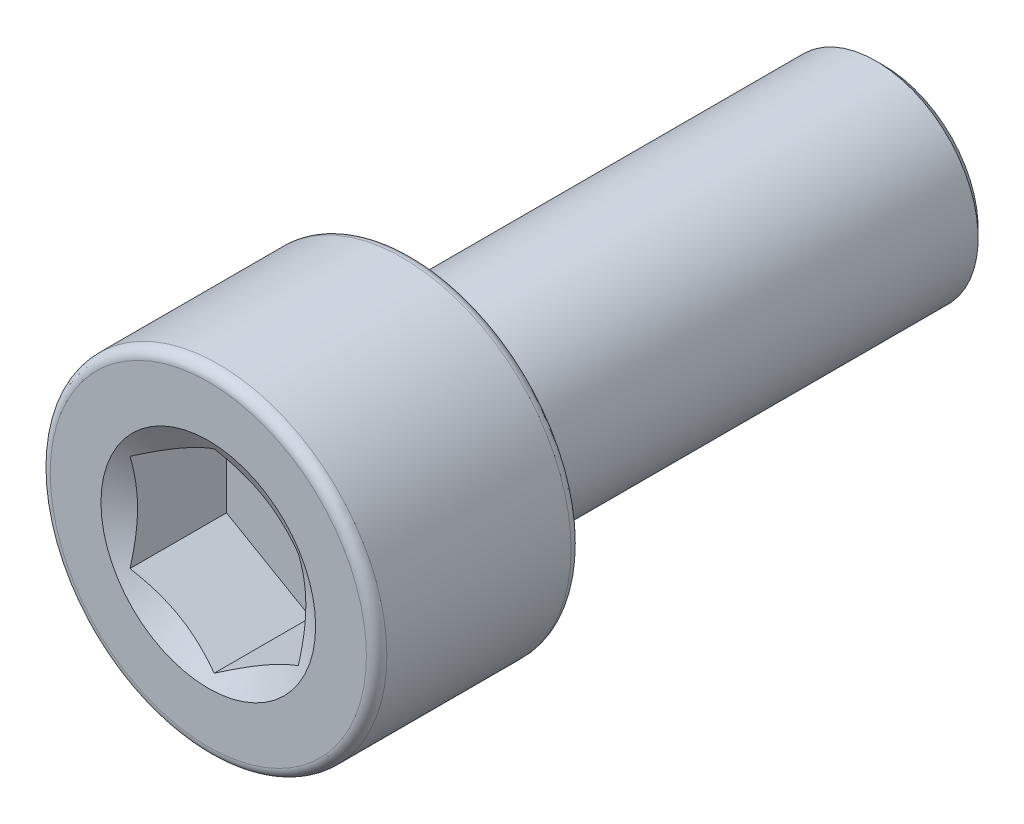
ISO-10303-21;
HEADER;
FILE_DESCRIPTION(('STEP AP214'),'2;1');
FILE_NAME('part.step','',(''),(''),'','','');
FILE_SCHEMA(('AUTOMOTIVE_DESIGN { 1 0 10303 214 1 1 1 1 }'));
ENDSEC;
DATA;
#1=APPLICATION_CONTEXT('core data for automotive mechanical design processes');
#2=APPLICATION_PROTOCOL_DEFINITION('international standard','automotive_design',2000,#1);
#3=PRODUCT_CONTEXT('',#1,'mechanical');
#4=PRODUCT('Part','Part','',(#3));
#5=PRODUCT_RELATED_PRODUCT_CATEGORY('part','',(#4));
#6=PRODUCT_DEFINITION_FORMATION('','',#4);
#7=PRODUCT_DEFINITION_CONTEXT('part definition',#1,'design');
#8=PRODUCT_DEFINITION('design','',#6,#7);
#9=PRODUCT_DEFINITION_SHAPE('','',#8);
#10=(LENGTH_UNIT() NAMED_UNIT(*) SI_UNIT(.MILLI.,.METRE.));
#11=(NAMED_UNIT(*) PLANE_ANGLE_UNIT() SI_UNIT($,.RADIAN.));
#12=(NAMED_UNIT(*) SI_UNIT($,.STERADIAN.) SOLID_ANGLE_UNIT());
#13=UNCERTAINTY_MEASURE_WITH_UNIT(LENGTH_MEASURE(1.E-05),#10,'distance_accuracy_value','');
#14=(GEOMETRIC_REPRESENTATION_CONTEXT(3) GLOBAL_UNCERTAINTY_ASSIGNED_CONTEXT((#13)) GLOBAL_UNIT_ASSIGNED_CONTEXT((#10,
#11,#12)) REPRESENTATION_CONTEXT('',''));
#15=CARTESIAN_POINT('',(0.,0.,0.));
#16=DIRECTION('',(0.,0.,1.));
#17=DIRECTION('',(1.,0.,0.));
#18=AXIS2_PLACEMENT_3D('',#15,#16,#17);
#19=CARTESIAN_POINT('',(0.,0.,-7.96925));
#20=DIRECTION('',(0.,0.,-1.));
#21=DIRECTION('',(-1.,0.,0.));
#22=AXIS2_PLACEMENT_3D('',#19,#20,#21);
#23=PLANE('',#22);
#24=CARTESIAN_POINT('',(0.,0.,-7.96925));
#25=DIRECTION('',(0.,0.,-1.));
#26=DIRECTION('',(-1.,0.,0.));
#27=AXIS2_PLACEMENT_3D('',#24,#25,#26);
#28=CIRCLE('',#27,2.21456250000001);
#29=CARTESIAN_POINT('',(-2.21456250000001,0.,-7.96925));
#30=VERTEX_POINT('',#29);
#31=EDGE_CURVE('E52',#30,#30,#28,.T.);
#32=ORIENTED_EDGE('',*,*,#31,.T.);
#33=EDGE_LOOP('',(#32));
#34=FACE_BOUND('',#33,.T.);
#35=ADVANCED_FACE('F39',(#34),#23,.T.);
#36=CARTESIAN_POINT('',(0.,0.,-7.96925));
#37=DIRECTION('',(0.,0.,1.));
#38=DIRECTION('',(1.,0.,0.));
#39=AXIS2_PLACEMENT_3D('',#36,#37,#38);
#40=CONICAL_SURFACE('',#39,2.21456250000001,0.785398163397452);
#41=CARTESIAN_POINT('',(0.,0.,-7.77081250000001));
#42=DIRECTION('',(0.,0.,-1.));
#43=DIRECTION('',(-1.,0.,0.));
#44=AXIS2_PLACEMENT_3D('',#41,#42,#43);
#45=CIRCLE('',#44,2.41300000000001);
#46=CARTESIAN_POINT('',(-2.41300000000001,0.,-7.77081250000001));
#47=VERTEX_POINT('',#46);
#48=EDGE_CURVE('E137',#47,#47,#45,.T.);
#49=ORIENTED_EDGE('',*,*,#48,.T.);
#50=EDGE_LOOP('',(#49));
#51=FACE_BOUND('',#50,.T.);
#52=ORIENTED_EDGE('',*,*,#31,.F.);
#53=EDGE_LOOP('',(#52));
#54=FACE_BOUND('',#53,.T.);
#55=ADVANCED_FACE('F143',(#51,#54),#40,.T.);
#56=CARTESIAN_POINT('',(0.,0.,-7.96925));
#57=DIRECTION('',(0.,0.,-1.));
#58=DIRECTION('',(-1.,0.,0.));
#59=AXIS2_PLACEMENT_3D('',#56,#57,#58);
#60=CYLINDRICAL_SURFACE('',#59,2.41300000000001);
#61=CARTESIAN_POINT('',(0.,0.,3.14325));
#62=DIRECTION('',(0.,0.,-1.));
#63=DIRECTION('',(-1.,0.,0.));
#64=AXIS2_PLACEMENT_3D('',#61,#62,#63);
#65=CIRCLE('',#64,2.41300000000001);
#66=CARTESIAN_POINT('',(-2.41300000000001,0.,3.14325));
#67=VERTEX_POINT('',#66);
#68=EDGE_CURVE('E134',#67,#67,#65,.T.);
#69=ORIENTED_EDGE('',*,*,#68,.T.);
#70=EDGE_LOOP('',(#69));
#71=FACE_BOUND('',#70,.T.);
#72=ORIENTED_EDGE('',*,*,#48,.F.);
#73=EDGE_LOOP('',(#72));
#74=FACE_BOUND('',#73,.T.);
#75=ADVANCED_FACE('F145',(#71,#74),#60,.T.);
#76=CARTESIAN_POINT('',(0.,2.413,3.14325));
#77=DIRECTION('',(0.,0.,-1.));
#78=DIRECTION('',(-1.,0.,0.));
#79=AXIS2_PLACEMENT_3D('',#76,#77,#78);
#80=PLANE('',#79);
#81=CARTESIAN_POINT('',(0.,0.,3.14325));
#82=DIRECTION('',(0.,0.,-1.));
#83=DIRECTION('',(-1.,0.,0.));
#84=AXIS2_PLACEMENT_3D('',#81,#82,#83);
#85=CIRCLE('',#84,3.72745);
#86=CARTESIAN_POINT('',(-3.72745,0.,3.14325));
#87=VERTEX_POINT('',#86);
#88=EDGE_CURVE('E131',#87,#87,#85,.T.);
#89=ORIENTED_EDGE('',*,*,#88,.T.);
#90=EDGE_LOOP('',(#89));
#91=FACE_BOUND('',#90,.T.);
#92=ORIENTED_EDGE('',*,*,#68,.F.);
#93=EDGE_LOOP('',(#92));
#94=FACE_BOUND('',#93,.T.);
#95=ADVANCED_FACE('F151',(#91,#94),#80,.T.);
#96=CARTESIAN_POINT('',(0.,0.,3.38455));
#97=DIRECTION('',(0.,0.,-1.));
#98=DIRECTION('',(-1.,0.,0.));
#99=AXIS2_PLACEMENT_3D('',#96,#97,#98);
#100=TOROIDAL_SURFACE('',#99,3.72745,0.241299999999999);
#101=CARTESIAN_POINT('',(0.,0.,3.38455));
#102=DIRECTION('',(0.,0.,-1.));
#103=DIRECTION('',(-1.,0.,0.));
#104=AXIS2_PLACEMENT_3D('',#101,#102,#103);
#105=CIRCLE('',#104,3.96875);
#106=CARTESIAN_POINT('',(-3.96875,0.,3.38455));
#107=VERTEX_POINT('',#106);
#108=EDGE_CURVE('E128',#107,#107,#105,.T.);
#109=ORIENTED_EDGE('',*,*,#108,.T.);
#110=EDGE_LOOP('',(#109));
#111=FACE_BOUND('',#110,.T.);
#112=ORIENTED_EDGE('',*,*,#88,.F.);
#113=EDGE_LOOP('',(#112));
#114=FACE_BOUND('',#113,.T.);
#115=ADVANCED_FACE('F157',(#111,#114),#100,.T.);
#116=CARTESIAN_POINT('',(0.,0.,-7.96925));
#117=DIRECTION('',(0.,0.,-1.));
#118=DIRECTION('',(-1.,0.,0.));
#119=AXIS2_PLACEMENT_3D('',#116,#117,#118);
#120=CYLINDRICAL_SURFACE('',#119,3.96875);
#121=CARTESIAN_POINT('',(0.,0.,7.72795));
#122=DIRECTION('',(0.,0.,-1.));
#123=DIRECTION('',(-1.,0.,0.));
#124=AXIS2_PLACEMENT_3D('',#121,#122,#123);
#125=CIRCLE('',#124,3.96875);
#126=CARTESIAN_POINT('',(-3.96875,0.,7.72795));
#127=VERTEX_POINT('',#126);
#128=EDGE_CURVE('E125',#127,#127,#125,.T.);
#129=ORIENTED_EDGE('',*,*,#128,.T.);
#130=EDGE_LOOP('',(#129));
#131=FACE_BOUND('',#130,.T.);
#132=ORIENTED_EDGE('',*,*,#108,.F.);
#133=EDGE_LOOP('',(#132));
#134=FACE_BOUND('',#133,.T.);
#135=ADVANCED_FACE('F161',(#131,#134),#120,.T.);
#136=CARTESIAN_POINT('',(0.,0.,7.72795));
#137=DIRECTION('',(0.,0.,-1.));
#138=DIRECTION('',(-1.,0.,0.));
#139=AXIS2_PLACEMENT_3D('',#136,#137,#138);
#140=TOROIDAL_SURFACE('',#139,3.72745,0.241300000000001);
#141=CARTESIAN_POINT('',(0.,0.,7.96925));
#142=DIRECTION('',(0.,0.,-1.));
#143=DIRECTION('',(-1.,0.,0.));
#144=AXIS2_PLACEMENT_3D('',#141,#142,#143);
#145=CIRCLE('',#144,3.72745);
#146=CARTESIAN_POINT('',(-3.72745,0.,7.96925));
#147=VERTEX_POINT('',#146);
#148=EDGE_CURVE('E122',#147,#147,#145,.T.);
#149=ORIENTED_EDGE('',*,*,#148,.T.);
#150=EDGE_LOOP('',(#149));
#151=FACE_BOUND('',#150,.T.);
#152=ORIENTED_EDGE('',*,*,#128,.F.);
#153=EDGE_LOOP('',(#152));
#154=FACE_BOUND('',#153,.T.);
#155=ADVANCED_FACE('F165',(#151,#154),#140,.T.);
#156=CARTESIAN_POINT('',(0.,3.72745,7.96925));
#157=DIRECTION('',(0.,0.,1.));
#158=DIRECTION('',(1.,0.,0.));
#159=AXIS2_PLACEMENT_3D('',#156,#157,#158);
#160=PLANE('',#159);
#161=CARTESIAN_POINT('',(0.,0.,7.96925));
#162=DIRECTION('',(0.,0.,1.));
#163=DIRECTION('',(1.,0.,0.));
#164=AXIS2_PLACEMENT_3D('',#161,#162,#163);
#165=CIRCLE('',#164,2.53070740070527);
#166=CARTESIAN_POINT('',(2.53070740070527,0.,7.96925));
#167=VERTEX_POINT('',#166);
#168=EDGE_CURVE('E259',#167,#167,#165,.T.);
#169=ORIENTED_EDGE('',*,*,#168,.F.);
#170=EDGE_LOOP('',(#169));
#171=FACE_BOUND('',#170,.T.);
#172=ORIENTED_EDGE('',*,*,#148,.F.);
#173=EDGE_LOOP('',(#172));
#174=FACE_BOUND('',#173,.T.);
#175=ADVANCED_FACE('F169',(#171,#174),#160,.T.);
#176=CARTESIAN_POINT('',(0.,0.,7.96925));
#177=DIRECTION('',(0.,0.,1.));
#178=DIRECTION('',(1.,0.,0.));
#179=AXIS2_PLACEMENT_3D('',#176,#177,#178);
#180=CONICAL_SURFACE('',#179,2.53070740070527,1.0471975511966);
#181=ORIENTED_EDGE('',*,*,#168,.T.);
#182=EDGE_LOOP('',(#181));
#183=FACE_BOUND('',#182,.T.);
#184=CARTESIAN_POINT('',(1.984575,1.14556397036932,7.83112873933508));
#185=CARTESIAN_POINT('',(1.89737036121932,1.19591159204393,7.80204774986949));
#186=CARTESIAN_POINT('',(1.809412980695,1.24669380936686,7.77559927565635));
#187=CARTESIAN_POINT('',(1.63197502132768,1.34913766297204,7.72943233883577));
#188=CARTESIAN_POINT('',(1.54249128874368,1.40080112006751,7.70973020987826));
#189=CARTESIAN_POINT('',(1.36463285198753,1.50348773640632,7.67905979956083));
#190=CARTESIAN_POINT('',(1.27628551969391,1.55449509248823,7.66788741034951));
#191=CARTESIAN_POINT('',(1.09917497188905,1.65674991493968,7.65454786368373));
#192=CARTESIAN_POINT('',(1.01041240048945,1.7079970094312,7.65236966208942));
#193=CARTESIAN_POINT('',(0.844542697135339,1.80376192731311,7.65689161913765));
#194=CARTESIAN_POINT('',(0.767410784334094,1.84829405793202,7.66248148108517));
#195=CARTESIAN_POINT('',(0.61364949281092,1.93706818098386,7.68020100152631));
#196=CARTESIAN_POINT('',(0.537020646254477,1.98130986617092,7.69233671795883));
#197=CARTESIAN_POINT('',(0.382942111493218,2.07026714969167,7.72267622647367));
#198=CARTESIAN_POINT('',(0.305511932787318,2.11497148421093,7.74100867692029));
#199=CARTESIAN_POINT('',(0.151806688756413,2.20371324822803,7.78261657402948));
#200=CARTESIAN_POINT('',(0.0755296529470687,2.24775181538554,7.80588223891168));
#201=CARTESIAN_POINT('',(-0.000199999999998771,2.29147435090016,7.83112873933508));
#202=B_SPLINE_CURVE_WITH_KNOTS('',3,(#184,#185,#186,#187,#188,#189,#190,#191,#192,#193,#194,
#195,#196,#197,#198,#199,#200,#201),.UNSPECIFIED.,.F.,.F.,(4,2,2,2,2,2,2,2,4),(0.,
0.314555137114085,0.629866549668805,0.937373439505931,1.24450262309398,1.51196650590478,
1.77967834211414,2.05332989762155,2.32644383656793),.UNSPECIFIED.);
#203=CARTESIAN_POINT('',(1.984375,1.14567944042316,7.8310620676293));
#204=VERTEX_POINT('',#203);
#205=CARTESIAN_POINT('',(0.,2.29135888084633,7.8310620676293));
#206=VERTEX_POINT('',#205);
#207=EDGE_CURVE('E106',#204,#206,#202,.T.);
#208=ORIENTED_EDGE('',*,*,#207,.F.);
#209=CARTESIAN_POINT('',(1.984375,-3.00026729742341,8.58494967649538));
#210=CARTESIAN_POINT('',(1.984375,-2.91417852714619,8.54350549951989));
#211=CARTESIAN_POINT('',(1.984375,-2.82788354366184,8.50248187013908));
#212=CARTESIAN_POINT('',(1.984375,-2.65477109089714,8.42151407198821));
#213=CARTESIAN_POINT('',(1.984375,-2.56795353399495,8.38157009078089));
#214=CARTESIAN_POINT('',(1.984375,-2.39320060303683,8.30278227563891));
#215=CARTESIAN_POINT('',(1.984375,-2.30526165499615,8.26394633973218));
#216=CARTESIAN_POINT('',(1.984375,-2.12865626167959,8.18797175349688));
#217=CARTESIAN_POINT('',(1.984375,-2.03998985361521,8.15083301698271));
#218=CARTESIAN_POINT('',(1.984375,-1.85931319770472,8.07770194440361));
#219=CARTESIAN_POINT('',(1.984375,-1.76727839255488,8.04176992963252));
#220=CARTESIAN_POINT('',(1.984375,-1.5821041626652,7.97281705863807));
#221=CARTESIAN_POINT('',(1.984375,-1.48896461158262,7.93979653909766));
#222=CARTESIAN_POINT('',(1.984375,-1.30163731722863,7.87759140823885));
#223=CARTESIAN_POINT('',(1.984375,-1.20745247053434,7.84839816641305));
#224=CARTESIAN_POINT('',(1.984375,-1.0177273513406,7.79483012996363));
#225=CARTESIAN_POINT('',(1.984375,-0.922187418803865,7.77045414893009));
#226=CARTESIAN_POINT('',(1.984375,-0.730187774437196,7.72786002525467));
#227=CARTESIAN_POINT('',(1.984375,-0.633734462555379,7.7096135885809));
#228=CARTESIAN_POINT('',(1.984375,-0.43971527635355,7.68037130332767));
#229=CARTESIAN_POINT('',(1.984375,-0.342149489314399,7.66937488986504));
#230=CARTESIAN_POINT('',(1.984375,-0.147628044199056,7.65565704177182));
#231=CARTESIAN_POINT('',(1.984375,-0.0506796597421229,7.65283541043542));
#232=CARTESIAN_POINT('',(1.984375,0.143103115571663,7.65543551472701));
#233=CARTESIAN_POINT('',(1.984375,0.239937499827363,7.66085770627661));
#234=CARTESIAN_POINT('',(1.984375,0.476970423936256,7.68374235498862));
#235=CARTESIAN_POINT('',(1.984375,0.616748292390846,7.70557704044363));
#236=CARTESIAN_POINT('',(1.984375,0.893607928884518,7.7623902077941));
#237=CARTESIAN_POINT('',(1.984375,1.03068676882901,7.79738221701726));
#238=CARTESIAN_POINT('',(1.984375,1.30511969999724,7.8776652230234));
#239=CARTESIAN_POINT('',(1.984375,1.44240893450287,7.92317266195429));
#240=CARTESIAN_POINT('',(1.984375,1.64644508842434,7.99651342467351));
#241=CARTESIAN_POINT('',(1.984375,1.71413212999322,8.02180330745833));
#242=CARTESIAN_POINT('',(1.984375,1.84895802350133,8.07380495153986));
#243=CARTESIAN_POINT('',(1.984375,1.91609688529706,8.10051668720586));
#244=CARTESIAN_POINT('',(1.984375,2.09043183263475,8.17166202677584));
#245=CARTESIAN_POINT('',(1.984375,2.19724734382524,8.2170257687467));
#246=CARTESIAN_POINT('',(1.984375,2.40988153193631,8.31003954608462));
#247=CARTESIAN_POINT('',(1.984375,2.51570012860562,8.35768976366227));
#248=CARTESIAN_POINT('',(1.984375,2.72655852247191,8.45475050523556));
#249=CARTESIAN_POINT('',(1.984375,2.83159810540155,8.50416149331034));
#250=CARTESIAN_POINT('',(1.984375,3.04102680140027,8.60434549136321));
#251=CARTESIAN_POINT('',(1.984375,3.14541589892039,8.65511853374661));
#252=CARTESIAN_POINT('',(1.984375,3.4580593439273,8.80916123856077));
#253=CARTESIAN_POINT('',(1.984375,3.66552471194406,8.91403051024588));
#254=CARTESIAN_POINT('',(1.984375,4.0790050250744,9.12649215286083));
#255=CARTESIAN_POINT('',(1.984375,4.28502019488326,9.23408408951456));
#256=CARTESIAN_POINT('',(1.984375,4.67597606585555,9.44054455222795));
#257=CARTESIAN_POINT('',(1.984375,4.86100920560763,9.53923831921385));
#258=CARTESIAN_POINT('',(1.984375,5.23047989061987,9.73775342169799));
#259=CARTESIAN_POINT('',(1.984375,5.41491740749769,9.83757480993869));
#260=CARTESIAN_POINT('',(1.984375,5.7828331411971,10.0377876967862));
#261=CARTESIAN_POINT('',(1.984375,5.96631260293183,10.1381769102676));
#262=CARTESIAN_POINT('',(1.984375,6.33289930192257,10.3396059236772));
#263=CARTESIAN_POINT('',(1.984375,6.51600656168202,10.4406456826348));
#264=CARTESIAN_POINT('',(1.984375,6.69898126466822,10.5419233706002));
#265=B_SPLINE_CURVE_WITH_KNOTS('',3,(#209,#210,#211,#212,#213,#214,#215,#216,#217,#218,#219,
#220,#221,#222,#223,#224,#225,#226,#227,#228,#229,#230,#231,#232,#233,#234,#235,#236,#237,#238,
#239,#240,#241,#242,#243,#244,#245,#246,#247,#248,#249,#250,#251,#252,#253,#254,#255,#256,#257,
#258,#259,#260,#261,#262,#263,#264),.UNSPECIFIED.,.F.,.F.,(4,2,2,2,2,2,2,2,2,2,2,2,2,2,2,2,2,2,
2,2,2,2,2,2,2,2,2,4),(0.,0.286639682230868,0.573328845206282,0.861712521681002,1.15008153741611,
1.4464446575425,1.74284200403624,2.03855903673009,2.33420314830461,2.62846318470746,
2.92270029122633,3.21331540991079,3.50394660154197,3.92748841830872,4.35146688350436,
4.78510306957841,5.00186448248402,5.2186219893087,5.56673163285506,5.91486906368419,
6.26309894038448,6.61133710935792,7.30869129939502,8.00593495112095,8.6350556277527,
9.26420585322016,9.89164710445796,10.5190492194134),.UNSPECIFIED.);
#266=CARTESIAN_POINT('',(1.984375,-1.14567944042316,7.8310620676293));
#267=VERTEX_POINT('',#266);
#268=EDGE_CURVE('E215',#267,#204,#265,.T.);
#269=ORIENTED_EDGE('',*,*,#268,.F.);
#270=CARTESIAN_POINT('',(-0.000200000000001408,-2.29147435090016,7.83112873933508));
#271=CARTESIAN_POINT('',(0.0870046387806746,-2.24112672922556,7.80204774986949));
#272=CARTESIAN_POINT('',(0.174962019304995,-2.19034451190263,7.77559927565635));
#273=CARTESIAN_POINT('',(0.352399978672318,-2.08790065829744,7.72943233883577));
#274=CARTESIAN_POINT('',(0.441883711256317,-2.03623720120198,7.70973020987826));
#275=CARTESIAN_POINT('',(0.619742148012467,-1.93355058486317,7.67905979956083));
#276=CARTESIAN_POINT('',(0.708089480306091,-1.88254322878126,7.66788741034951));
#277=CARTESIAN_POINT('',(0.885200028110948,-1.78028840632981,7.65454786368373));
#278=CARTESIAN_POINT('',(0.973962599510545,-1.72904131183829,7.65236966208942));
#279=CARTESIAN_POINT('',(1.13983230286466,-1.63327639395638,7.65689161913765));
#280=CARTESIAN_POINT('',(1.2169642156659,-1.58874426333747,7.66248148108517));
#281=CARTESIAN_POINT('',(1.37072550718908,-1.49997014028562,7.68020100152631));
#282=CARTESIAN_POINT('',(1.44735435374552,-1.45572845509857,7.69233671795882));
#283=CARTESIAN_POINT('',(1.60143288850678,-1.36677117157782,7.72267622647366));
#284=CARTESIAN_POINT('',(1.67886306721268,-1.32206683705856,7.74100867692029));
#285=CARTESIAN_POINT('',(1.83256831124359,-1.23332507304146,7.78261657402948));
#286=CARTESIAN_POINT('',(1.90884534705293,-1.18928650588395,7.80588223891168));
#287=CARTESIAN_POINT('',(1.984575,-1.14556397036933,7.83112873933508));
#288=B_SPLINE_CURVE_WITH_KNOTS('',3,(#270,#271,#272,#273,#274,#275,#276,#277,#278,#279,#280,
#281,#282,#283,#284,#285,#286,#287),.UNSPECIFIED.,.F.,.F.,(4,2,2,2,2,2,2,2,4),(0.,
0.314555137114085,0.629866549668806,0.937373439505932,1.24450262309398,1.51196650590478,
1.77967834211415,2.05332989762155,2.32644383656793),.UNSPECIFIED.);
#289=CARTESIAN_POINT('',(0.,-2.29135888084633,7.8310620676293));
#290=VERTEX_POINT('',#289);
#291=EDGE_CURVE('E209',#290,#267,#288,.T.);
#292=ORIENTED_EDGE('',*,*,#291,.F.);
#293=CARTESIAN_POINT('',(-1.984575,-1.14556397036933,7.83112873933508));
#294=CARTESIAN_POINT('',(-1.89737036121932,-1.19591159204393,7.80204774986949));
#295=CARTESIAN_POINT('',(-1.809412980695,-1.24669380936686,7.77559927565635));
#296=CARTESIAN_POINT('',(-1.63197502132768,-1.34913766297205,7.72943233883577));
#297=CARTESIAN_POINT('',(-1.54249128874368,-1.40080112006751,7.70973020987826));
#298=CARTESIAN_POINT('',(-1.36463285198753,-1.50348773640632,7.67905979956083));
#299=CARTESIAN_POINT('',(-1.27628551969391,-1.55449509248823,7.66788741034951));
#300=CARTESIAN_POINT('',(-1.09917497188905,-1.65674991493968,7.65454786368373));
#301=CARTESIAN_POINT('',(-1.01041240048945,-1.70799700943121,7.65236966208942));
#302=CARTESIAN_POINT('',(-0.844542697135338,-1.80376192731311,7.65689161913765));
#303=CARTESIAN_POINT('',(-0.767410784334093,-1.84829405793202,7.66248148108517));
#304=CARTESIAN_POINT('',(-0.613649492810919,-1.93706818098387,7.68020100152631));
#305=CARTESIAN_POINT('',(-0.537020646254476,-1.98130986617092,7.69233671795883));
#306=CARTESIAN_POINT('',(-0.382942111493217,-2.07026714969167,7.72267622647367));
#307=CARTESIAN_POINT('',(-0.305511932787318,-2.11497148421093,7.74100867692029));
#308=CARTESIAN_POINT('',(-0.151806688756412,-2.20371324822803,7.78261657402948));
#309=CARTESIAN_POINT('',(-0.0755296529470686,-2.24775181538554,7.80588223891168));
#310=CARTESIAN_POINT('',(0.000199999999998751,-2.29147435090016,7.83112873933508));
#311=B_SPLINE_CURVE_WITH_KNOTS('',3,(#293,#294,#295,#296,#297,#298,#299,#300,#301,#302,#303,
#304,#305,#306,#307,#308,#309,#310),.UNSPECIFIED.,.F.,.F.,(4,2,2,2,2,2,2,2,4),(0.,
0.314555137114085,0.629866549668805,0.937373439505931,1.24450262309398,1.51196650590478,
1.77967834211414,2.05332989762154,2.32644383656793),.UNSPECIFIED.);
#312=CARTESIAN_POINT('',(-1.984375,-1.14567944042316,7.8310620676293));
#313=VERTEX_POINT('',#312);
#314=EDGE_CURVE('E59',#313,#290,#311,.T.);
#315=ORIENTED_EDGE('',*,*,#314,.F.);
#316=CARTESIAN_POINT('',(-1.984375,-3.00026729754376,8.58494967655334));
#317=CARTESIAN_POINT('',(-1.984375,-2.9141785272625,8.54350549957539));
#318=CARTESIAN_POINT('',(-1.984375,-2.82788354377411,8.50248187019213));
#319=CARTESIAN_POINT('',(-1.984375,-2.65477109100131,8.42151407203638));
#320=CARTESIAN_POINT('',(-1.984375,-2.56795353409507,8.38157009082663));
#321=CARTESIAN_POINT('',(-1.984375,-2.39320060312877,8.30278227567976));
#322=CARTESIAN_POINT('',(-1.984375,-2.30526165508396,8.2639463397706));
#323=CARTESIAN_POINT('',(-1.984375,-2.12865626175912,8.18797175353045));
#324=CARTESIAN_POINT('',(-1.984375,-2.03998985369058,8.15083301701388));
#325=CARTESIAN_POINT('',(-1.984375,-1.85931319777155,8.07770194442997));
#326=CARTESIAN_POINT('',(-1.984375,-1.7672783926173,8.04176992965647));
#327=CARTESIAN_POINT('',(-1.984375,-1.58210416271874,7.97281705865731));
#328=CARTESIAN_POINT('',(-1.984375,-1.48896461163169,7.93979653911462));
#329=CARTESIAN_POINT('',(-1.984375,-1.30163731726866,7.87759140825147));
#330=CARTESIAN_POINT('',(-1.984375,-1.20745247056981,7.84839816642363));
#331=CARTESIAN_POINT('',(-1.984375,-1.01772735136682,7.79483012997047));
#332=CARTESIAN_POINT('',(-1.984375,-0.922187418825392,7.77045414893523));
#333=CARTESIAN_POINT('',(-1.984375,-0.730187774446772,7.72786002525643));
#334=CARTESIAN_POINT('',(-1.984375,-0.63373446255766,7.70961358858111));
#335=CARTESIAN_POINT('',(-1.984375,-0.439715276341083,7.68037130332592));
#336=CARTESIAN_POINT('',(-1.984375,-0.342149489294478,7.66937488986287));
#337=CARTESIAN_POINT('',(-1.984375,-0.147628044164359,7.65565704177013));
#338=CARTESIAN_POINT('',(-1.984375,-0.0506796597001036,7.65283541043459));
#339=CARTESIAN_POINT('',(-1.984375,0.143103115628193,7.65543551472916));
#340=CARTESIAN_POINT('',(-1.984375,0.239937499891084,7.66085770628085));
#341=CARTESIAN_POINT('',(-1.984375,0.476970424011514,7.68374235499865));
#342=CARTESIAN_POINT('',(-1.984375,0.616748292470371,7.70557704045721));
#343=CARTESIAN_POINT('',(-1.984375,0.893607928972295,7.76239020781488));
#344=CARTESIAN_POINT('',(-1.984375,1.03068676892077,7.79738221704169));
#345=CARTESIAN_POINT('',(-1.984375,1.305119700097,7.87766522305506));
#346=CARTESIAN_POINT('',(-1.984375,1.44240893460666,7.92317266198955));
#347=CARTESIAN_POINT('',(-1.984375,1.64644508853414,7.996513424714));
#348=CARTESIAN_POINT('',(-1.984375,1.71413213010502,8.02180330750053));
#349=CARTESIAN_POINT('',(-1.984375,1.84895802361712,8.07380495158544));
#350=CARTESIAN_POINT('',(-1.984375,1.91609688541485,8.1005166872531));
#351=CARTESIAN_POINT('',(-1.984375,2.09043183275382,8.17166202682576));
#352=CARTESIAN_POINT('',(-1.984375,2.19724734394363,8.21702576879747));
#353=CARTESIAN_POINT('',(-1.984375,2.40988153205344,8.31003954613687));
#354=CARTESIAN_POINT('',(-1.984375,2.51570012872216,8.35768976371513));
#355=CARTESIAN_POINT('',(-1.984375,2.72655852258734,8.45475050528947));
#356=CARTESIAN_POINT('',(-1.984375,2.83159810551645,8.5041614933647));
#357=CARTESIAN_POINT('',(-1.984375,3.04102680151418,8.60434549141831));
#358=CARTESIAN_POINT('',(-1.984375,3.14541589903382,8.65511853380202));
#359=CARTESIAN_POINT('',(-1.984375,3.45805934403933,8.80916123861694));
#360=CARTESIAN_POINT('',(-1.984375,3.66552471205522,8.91403051030237));
#361=CARTESIAN_POINT('',(-1.984375,4.07900502518394,9.12649215291773));
#362=CARTESIAN_POINT('',(-1.984375,4.28502019499204,9.23408408957157));
#363=CARTESIAN_POINT('',(-1.984375,4.67597606596364,9.44054455228542));
#364=CARTESIAN_POINT('',(-1.984375,4.86100920571578,9.53923831927167));
#365=CARTESIAN_POINT('',(-1.984375,5.23047989072817,9.73775342175647));
#366=CARTESIAN_POINT('',(-1.984375,5.41491740760609,9.83757480999746));
#367=CARTESIAN_POINT('',(-1.984375,5.7828331413058,10.0377876968455));
#368=CARTESIAN_POINT('',(-1.984375,5.96631260304073,10.1381769103272));
#369=CARTESIAN_POINT('',(-1.984375,6.33289930203189,10.3396059237374));
#370=CARTESIAN_POINT('',(-1.984375,6.51600656179157,10.4406456826953));
#371=CARTESIAN_POINT('',(-1.984375,6.69898126477799,10.541923370661));
#372=B_SPLINE_CURVE_WITH_KNOTS('',3,(#316,#317,#318,#319,#320,#321,#322,#323,#324,#325,#326,
#327,#328,#329,#330,#331,#332,#333,#334,#335,#336,#337,#338,#339,#340,#341,#342,#343,#344,#345,
#346,#347,#348,#349,#350,#351,#352,#353,#354,#355,#356,#357,#358,#359,#360,#361,#362,#363,#364,
#365,#366,#367,#368,#369,#370,#371),.UNSPECIFIED.,.F.,.F.,(4,2,2,2,2,2,2,2,2,2,2,2,2,2,2,2,2,2,
2,2,2,2,2,2,2,2,2,4),(0.,0.286639682244971,0.573328845234491,0.86171252172349,1.15008153747288,
1.4464446576142,1.74284200412288,2.03855903683161,2.334203148421,2.62846318484617,
2.92270029138732,3.21331541009358,3.50394660174658,3.9274884185276,4.35146688373754,
4.78510306982646,5.00186448273948,5.21862198957159,5.5667316331171,5.91486906394539,
6.26309894064481,6.61133710961737,7.30869129965259,8.00593495137665,8.63505562800908,
9.2642058534772,9.89164710471596,10.5190492196724),.UNSPECIFIED.);
#373=CARTESIAN_POINT('',(-1.984375,1.14567944042316,7.8310620676293));
#374=VERTEX_POINT('',#373);
#375=EDGE_CURVE('E11',#374,#313,#372,.F.);
#376=ORIENTED_EDGE('',*,*,#375,.F.);
#377=CARTESIAN_POINT('',(0.000200000000001245,2.29147435090016,7.83112873933508));
#378=CARTESIAN_POINT('',(-0.0870046387806749,2.24112672922556,7.80204774986949));
#379=CARTESIAN_POINT('',(-0.174962019304995,2.19034451190263,7.77559927565635));
#380=CARTESIAN_POINT('',(-0.352399978672318,2.08790065829744,7.72943233883577));
#381=CARTESIAN_POINT('',(-0.441883711256317,2.03623720120198,7.70973020987826));
#382=CARTESIAN_POINT('',(-0.619742148012467,1.93355058486317,7.67905979956083));
#383=CARTESIAN_POINT('',(-0.708089480306091,1.88254322878126,7.66788741034951));
#384=CARTESIAN_POINT('',(-0.885200028110948,1.78028840632981,7.65454786368373));
#385=CARTESIAN_POINT('',(-0.973962599510544,1.72904131183828,7.65236966208942));
#386=CARTESIAN_POINT('',(-1.13983230286466,1.63327639395638,7.65689161913765));
#387=CARTESIAN_POINT('',(-1.2169642156659,1.58874426333747,7.66248148108517));
#388=CARTESIAN_POINT('',(-1.37072550718908,1.49997014028562,7.68020100152631));
#389=CARTESIAN_POINT('',(-1.44735435374552,1.45572845509857,7.69233671795882));
#390=CARTESIAN_POINT('',(-1.60143288850678,1.36677117157782,7.72267622647366));
#391=CARTESIAN_POINT('',(-1.67886306721268,1.32206683705856,7.74100867692029));
#392=CARTESIAN_POINT('',(-1.83256831124359,1.23332507304146,7.78261657402948));
#393=CARTESIAN_POINT('',(-1.90884534705293,1.18928650588395,7.80588223891168));
#394=CARTESIAN_POINT('',(-1.984575,1.14556397036932,7.83112873933508));
#395=B_SPLINE_CURVE_WITH_KNOTS('',3,(#377,#378,#379,#380,#381,#382,#383,#384,#385,#386,#387,
#388,#389,#390,#391,#392,#393,#394),.UNSPECIFIED.,.F.,.F.,(4,2,2,2,2,2,2,2,4),(0.,
0.314555137114086,0.629866549668806,0.937373439505932,1.24450262309398,1.51196650590478,
1.77967834211415,2.05332989762155,2.32644383656793),.UNSPECIFIED.);
#396=EDGE_CURVE('E97',#206,#374,#395,.T.);
#397=ORIENTED_EDGE('',*,*,#396,.F.);
#398=EDGE_LOOP('',(#208,#269,#292,#315,#376,#397));
#399=FACE_BOUND('',#398,.T.);
#400=ADVANCED_FACE('F96',(#183,#399),#180,.F.);
#401=CARTESIAN_POINT('',(0.,0.,5.55625));
#402=DIRECTION('',(0.,0.,1.));
#403=DIRECTION('',(1.,0.,0.));
#404=AXIS2_PLACEMENT_3D('',#401,#402,#403);
#405=PLANE('',#404);
#406=DIRECTION('',(-0.866025403784438,-0.5,0.));
#407=VECTOR('',#406,1.);
#408=CARTESIAN_POINT('',(0.,2.29135888084633,5.55625));
#409=LINE('',#408,#407);
#410=CARTESIAN_POINT('',(0.,2.29135888084633,5.55625));
#411=VERTEX_POINT('',#410);
#412=CARTESIAN_POINT('',(-1.984375,1.14567944042316,5.55625));
#413=VERTEX_POINT('',#412);
#414=EDGE_CURVE('E105',#411,#413,#409,.T.);
#415=ORIENTED_EDGE('',*,*,#414,.T.);
#416=DIRECTION('',(0.,-1.,0.));
#417=VECTOR('',#416,1.);
#418=CARTESIAN_POINT('',(-1.984375,1.14567944042316,5.55625));
#419=LINE('',#418,#417);
#420=CARTESIAN_POINT('',(-1.984375,-1.14567944042316,5.55625));
#421=VERTEX_POINT('',#420);
#422=EDGE_CURVE('E110',#413,#421,#419,.T.);
#423=ORIENTED_EDGE('',*,*,#422,.T.);
#424=DIRECTION('',(0.866025403784439,-0.5,0.));
#425=VECTOR('',#424,1.);
#426=CARTESIAN_POINT('',(-1.984375,-1.14567944042316,5.55625));
#427=LINE('',#426,#425);
#428=CARTESIAN_POINT('',(0.,-2.29135888084633,5.55625));
#429=VERTEX_POINT('',#428);
#430=EDGE_CURVE('E241',#421,#429,#427,.T.);
#431=ORIENTED_EDGE('',*,*,#430,.T.);
#432=DIRECTION('',(0.866025403784439,0.5,0.));
#433=VECTOR('',#432,1.);
#434=CARTESIAN_POINT('',(0.,-2.29135888084633,5.55625));
#435=LINE('',#434,#433);
#436=CARTESIAN_POINT('',(1.984375,-1.14567944042316,5.55625));
#437=VERTEX_POINT('',#436);
#438=EDGE_CURVE('E245',#429,#437,#435,.T.);
#439=ORIENTED_EDGE('',*,*,#438,.T.);
#440=DIRECTION('',(0.,1.,0.));
#441=VECTOR('',#440,1.);
#442=CARTESIAN_POINT('',(1.984375,-1.14567944042316,5.55625));
#443=LINE('',#442,#441);
#444=CARTESIAN_POINT('',(1.984375,1.14567944042316,5.55625));
#445=VERTEX_POINT('',#444);
#446=EDGE_CURVE('E118',#437,#445,#443,.T.);
#447=ORIENTED_EDGE('',*,*,#446,.T.);
#448=DIRECTION('',(-0.866025403784438,0.5,0.));
#449=VECTOR('',#448,1.);
#450=CARTESIAN_POINT('',(1.984375,1.14567944042316,5.55625));
#451=LINE('',#450,#449);
#452=EDGE_CURVE('E113',#445,#411,#451,.T.);
#453=ORIENTED_EDGE('',*,*,#452,.T.);
#454=EDGE_LOOP('',(#415,#423,#431,#439,#447,#453));
#455=FACE_BOUND('',#454,.T.);
#456=ADVANCED_FACE('F195',(#455),#405,.T.);
#457=CARTESIAN_POINT('',(-1.984375,1.14567944042316,5.55625));
#458=DIRECTION('',(-1.,0.,0.));
#459=DIRECTION('',(0.,-1.,0.));
#460=AXIS2_PLACEMENT_3D('',#457,#458,#459);
#461=PLANE('',#460);
#462=DIRECTION('',(0.,0.,1.));
#463=VECTOR('',#462,1.);
#464=CARTESIAN_POINT('',(-1.984375,1.14567944042316,5.55625));
#465=LINE('',#464,#463);
#466=EDGE_CURVE('E103',#413,#374,#465,.T.);
#467=ORIENTED_EDGE('',*,*,#466,.T.);
#468=ORIENTED_EDGE('',*,*,#375,.T.);
#469=DIRECTION('',(0.,0.,1.));
#470=VECTOR('',#469,1.);
#471=CARTESIAN_POINT('',(-1.984375,-1.14567944042316,5.55625));
#472=LINE('',#471,#470);
#473=EDGE_CURVE('E112',#421,#313,#472,.T.);
#474=ORIENTED_EDGE('',*,*,#473,.F.);
#475=ORIENTED_EDGE('',*,*,#422,.F.);
#476=EDGE_LOOP('',(#467,#468,#474,#475));
#477=FACE_BOUND('',#476,.T.);
#478=ADVANCED_FACE('F108',(#477),#461,.F.);
#479=CARTESIAN_POINT('',(-1.984375,-1.14567944042316,5.55625));
#480=DIRECTION('',(-0.5,-0.866025403784439,0.));
#481=DIRECTION('',(0.866025403784439,-0.5,0.));
#482=AXIS2_PLACEMENT_3D('',#479,#480,#481);
#483=PLANE('',#482);
#484=ORIENTED_EDGE('',*,*,#473,.T.);
#485=ORIENTED_EDGE('',*,*,#314,.T.);
#486=DIRECTION('',(0.,0.,1.));
#487=VECTOR('',#486,1.);
#488=CARTESIAN_POINT('',(0.,-2.29135888084633,5.55625));
#489=LINE('',#488,#487);
#490=EDGE_CURVE('E115',#429,#290,#489,.T.);
#491=ORIENTED_EDGE('',*,*,#490,.F.);
#492=ORIENTED_EDGE('',*,*,#430,.F.);
#493=EDGE_LOOP('',(#484,#485,#491,#492));
#494=FACE_BOUND('',#493,.T.);
#495=ADVANCED_FACE('F230',(#494),#483,.F.);
#496=CARTESIAN_POINT('',(0.,-2.29135888084633,5.55625));
#497=DIRECTION('',(0.5,-0.866025403784439,0.));
#498=DIRECTION('',(0.866025403784439,0.5,0.));
#499=AXIS2_PLACEMENT_3D('',#496,#497,#498);
#500=PLANE('',#499);
#501=ORIENTED_EDGE('',*,*,#490,.T.);
#502=ORIENTED_EDGE('',*,*,#291,.T.);
#503=DIRECTION('',(0.,0.,1.));
#504=VECTOR('',#503,1.);
#505=CARTESIAN_POINT('',(1.984375,-1.14567944042316,5.55625));
#506=LINE('',#505,#504);
#507=EDGE_CURVE('E255',#437,#267,#506,.T.);
#508=ORIENTED_EDGE('',*,*,#507,.F.);
#509=ORIENTED_EDGE('',*,*,#438,.F.);
#510=EDGE_LOOP('',(#501,#502,#508,#509));
#511=FACE_BOUND('',#510,.T.);
#512=ADVANCED_FACE('F225',(#511),#500,.F.);
#513=CARTESIAN_POINT('',(1.984375,-1.14567944042316,5.55625));
#514=DIRECTION('',(1.,0.,0.));
#515=DIRECTION('',(0.,0.,-1.));
#516=AXIS2_PLACEMENT_3D('',#513,#514,#515);
#517=PLANE('',#516);
#518=ORIENTED_EDGE('',*,*,#507,.T.);
#519=ORIENTED_EDGE('',*,*,#268,.T.);
#520=DIRECTION('',(0.,0.,1.));
#521=VECTOR('',#520,1.);
#522=CARTESIAN_POINT('',(1.984375,1.14567944042316,5.55625));
#523=LINE('',#522,#521);
#524=EDGE_CURVE('E252',#445,#204,#523,.T.);
#525=ORIENTED_EDGE('',*,*,#524,.F.);
#526=ORIENTED_EDGE('',*,*,#446,.F.);
#527=EDGE_LOOP('',(#518,#519,#525,#526));
#528=FACE_BOUND('',#527,.T.);
#529=ADVANCED_FACE('F222',(#528),#517,.F.);
#530=CARTESIAN_POINT('',(1.984375,1.14567944042316,5.55625));
#531=DIRECTION('',(0.5,0.866025403784438,0.));
#532=DIRECTION('',(-0.866025403784438,0.5,0.));
#533=AXIS2_PLACEMENT_3D('',#530,#531,#532);
#534=PLANE('',#533);
#535=ORIENTED_EDGE('',*,*,#524,.T.);
#536=ORIENTED_EDGE('',*,*,#207,.T.);
#537=DIRECTION('',(0.,0.,1.));
#538=VECTOR('',#537,1.);
#539=CARTESIAN_POINT('',(0.,2.29135888084633,5.55625));
#540=LINE('',#539,#538);
#541=EDGE_CURVE('E66',#411,#206,#540,.T.);
#542=ORIENTED_EDGE('',*,*,#541,.F.);
#543=ORIENTED_EDGE('',*,*,#452,.F.);
#544=EDGE_LOOP('',(#535,#536,#542,#543));
#545=FACE_BOUND('',#544,.T.);
#546=ADVANCED_FACE('F176',(#545),#534,.F.);
#547=CARTESIAN_POINT('',(0.,2.29135888084633,5.55625));
#548=DIRECTION('',(-0.5,0.866025403784438,0.));
#549=DIRECTION('',(-0.866025403784439,-0.5,0.));
#550=AXIS2_PLACEMENT_3D('',#547,#548,#549);
#551=PLANE('',#550);
#552=ORIENTED_EDGE('',*,*,#541,.T.);
#553=ORIENTED_EDGE('',*,*,#396,.T.);
#554=ORIENTED_EDGE('',*,*,#466,.F.);
#555=ORIENTED_EDGE('',*,*,#414,.F.);
#556=EDGE_LOOP('',(#552,#553,#554,#555));
#557=FACE_BOUND('',#556,.T.);
#558=ADVANCED_FACE('F102',(#557),#551,.F.);
#559=CLOSED_SHELL('',(#35,#55,#75,#95,#115,#135,#155,#175,#400,#456,#478,#495,#512,#529,#546,#558));
#560=MANIFOLD_SOLID_BREP('B2',#559);
#561=ADVANCED_BREP_SHAPE_REPRESENTATION('',(#18,#560),#14);
#562=SHAPE_DEFINITION_REPRESENTATION(#9,#561);
ENDSEC;
END-ISO-10303-21;
